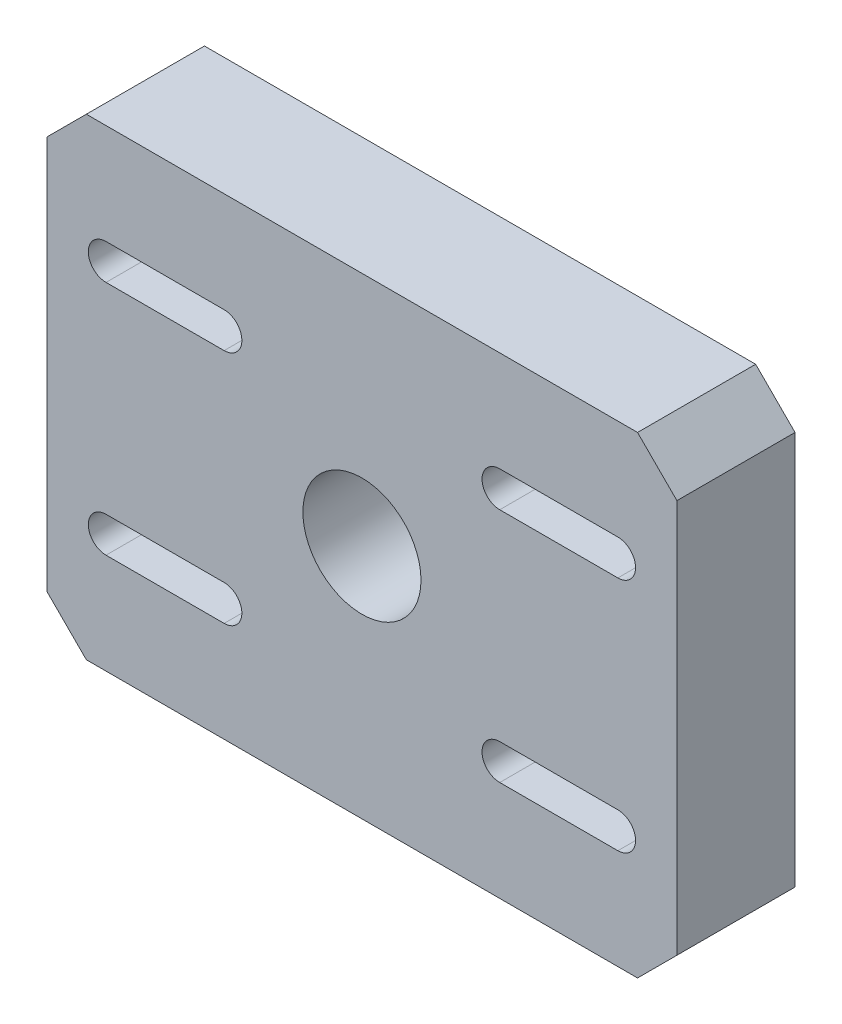
ISO-10303-21;
HEADER;
FILE_DESCRIPTION(('STEP AP214'),'2;1');
FILE_NAME('part.step','',(''),(''),'','','');
FILE_SCHEMA(('AUTOMOTIVE_DESIGN { 1 0 10303 214 1 1 1 1 }'));
ENDSEC;
DATA;
#1=APPLICATION_CONTEXT('core data for automotive mechanical design processes');
#2=APPLICATION_PROTOCOL_DEFINITION('international standard','automotive_design',2000,#1);
#3=PRODUCT_CONTEXT('',#1,'mechanical');
#4=PRODUCT('Part','Part','',(#3));
#5=PRODUCT_RELATED_PRODUCT_CATEGORY('part','',(#4));
#6=PRODUCT_DEFINITION_FORMATION('','',#4);
#7=PRODUCT_DEFINITION_CONTEXT('part definition',#1,'design');
#8=PRODUCT_DEFINITION('design','',#6,#7);
#9=PRODUCT_DEFINITION_SHAPE('','',#8);
#10=(LENGTH_UNIT() NAMED_UNIT(*) SI_UNIT(.MILLI.,.METRE.));
#11=(NAMED_UNIT(*) PLANE_ANGLE_UNIT() SI_UNIT($,.RADIAN.));
#12=(NAMED_UNIT(*) SI_UNIT($,.STERADIAN.) SOLID_ANGLE_UNIT());
#13=UNCERTAINTY_MEASURE_WITH_UNIT(LENGTH_MEASURE(1.E-05),#10,'distance_accuracy_value','');
#14=(GEOMETRIC_REPRESENTATION_CONTEXT(3) GLOBAL_UNCERTAINTY_ASSIGNED_CONTEXT((#13)) GLOBAL_UNIT_ASSIGNED_CONTEXT((#10,
#11,#12)) REPRESENTATION_CONTEXT('',''));
#15=CARTESIAN_POINT('',(0.,0.,0.));
#16=DIRECTION('',(0.,0.,1.));
#17=DIRECTION('',(1.,0.,0.));
#18=AXIS2_PLACEMENT_3D('',#15,#16,#17);
#19=CARTESIAN_POINT('',(-80.,-60.,30.));
#20=DIRECTION('',(1.,0.,0.));
#21=DIRECTION('',(0.,0.,-1.));
#22=AXIS2_PLACEMENT_3D('',#19,#20,#21);
#23=PLANE('',#22);
#24=DIRECTION('',(0.,-1.,0.));
#25=VECTOR('',#24,1.);
#26=CARTESIAN_POINT('',(-80.,-60.,0.));
#27=LINE('',#26,#25);
#28=CARTESIAN_POINT('',(-80.,50.,0.));
#29=VERTEX_POINT('',#28);
#30=CARTESIAN_POINT('',(-80.,-50.,0.));
#31=VERTEX_POINT('',#30);
#32=EDGE_CURVE('E333',#29,#31,#27,.T.);
#33=ORIENTED_EDGE('',*,*,#32,.T.);
#34=DIRECTION('',(0.,0.,1.));
#35=VECTOR('',#34,1.);
#36=CARTESIAN_POINT('',(-80.,-50.,30.));
#37=LINE('',#36,#35);
#38=CARTESIAN_POINT('',(-80.,-50.,30.));
#39=VERTEX_POINT('',#38);
#40=EDGE_CURVE('E11',#31,#39,#37,.T.);
#41=ORIENTED_EDGE('',*,*,#40,.T.);
#42=DIRECTION('',(0.,-1.,0.));
#43=VECTOR('',#42,1.);
#44=CARTESIAN_POINT('',(-80.,-60.,30.));
#45=LINE('',#44,#43);
#46=CARTESIAN_POINT('',(-80.,50.,30.));
#47=VERTEX_POINT('',#46);
#48=EDGE_CURVE('E340',#47,#39,#45,.T.);
#49=ORIENTED_EDGE('',*,*,#48,.F.);
#50=DIRECTION('',(0.,0.,-1.));
#51=VECTOR('',#50,1.);
#52=CARTESIAN_POINT('',(-80.,50.,30.));
#53=LINE('',#52,#51);
#54=EDGE_CURVE('E42',#47,#29,#53,.T.);
#55=ORIENTED_EDGE('',*,*,#54,.T.);
#56=EDGE_LOOP('',(#33,#41,#49,#55));
#57=FACE_BOUND('',#56,.T.);
#58=ADVANCED_FACE('F34',(#57),#23,.F.);
#59=CARTESIAN_POINT('',(80.,-60.,30.));
#60=DIRECTION('',(0.,1.,0.));
#61=DIRECTION('',(-1.,0.,0.));
#62=AXIS2_PLACEMENT_3D('',#59,#60,#61);
#63=PLANE('',#62);
#64=DIRECTION('',(1.,0.,0.));
#65=VECTOR('',#64,1.);
#66=CARTESIAN_POINT('',(80.,-60.,0.));
#67=LINE('',#66,#65);
#68=CARTESIAN_POINT('',(-70.,-60.,0.));
#69=VERTEX_POINT('',#68);
#70=CARTESIAN_POINT('',(70.,-60.,0.));
#71=VERTEX_POINT('',#70);
#72=EDGE_CURVE('E354',#69,#71,#67,.T.);
#73=ORIENTED_EDGE('',*,*,#72,.T.);
#74=DIRECTION('',(0.,0.,1.));
#75=VECTOR('',#74,1.);
#76=CARTESIAN_POINT('',(70.,-60.,30.));
#77=LINE('',#76,#75);
#78=CARTESIAN_POINT('',(70.,-60.,30.));
#79=VERTEX_POINT('',#78);
#80=EDGE_CURVE('E376',#71,#79,#77,.T.);
#81=ORIENTED_EDGE('',*,*,#80,.T.);
#82=DIRECTION('',(1.,0.,0.));
#83=VECTOR('',#82,1.);
#84=CARTESIAN_POINT('',(80.,-60.,30.));
#85=LINE('',#84,#83);
#86=CARTESIAN_POINT('',(-70.,-60.,30.));
#87=VERTEX_POINT('',#86);
#88=EDGE_CURVE('E343',#87,#79,#85,.T.);
#89=ORIENTED_EDGE('',*,*,#88,.F.);
#90=DIRECTION('',(0.,0.,-1.));
#91=VECTOR('',#90,1.);
#92=CARTESIAN_POINT('',(-70.,-60.,30.));
#93=LINE('',#92,#91);
#94=EDGE_CURVE('E373',#87,#69,#93,.T.);
#95=ORIENTED_EDGE('',*,*,#94,.T.);
#96=EDGE_LOOP('',(#73,#81,#89,#95));
#97=FACE_BOUND('',#96,.T.);
#98=ADVANCED_FACE('F406',(#97),#63,.F.);
#99=CARTESIAN_POINT('',(80.,-60.,30.));
#100=DIRECTION('',(-1.,0.,0.));
#101=DIRECTION('',(0.,0.,1.));
#102=AXIS2_PLACEMENT_3D('',#99,#100,#101);
#103=PLANE('',#102);
#104=DIRECTION('',(0.,1.,0.));
#105=VECTOR('',#104,1.);
#106=CARTESIAN_POINT('',(80.,-60.,30.));
#107=LINE('',#106,#105);
#108=CARTESIAN_POINT('',(80.,-50.,30.));
#109=VERTEX_POINT('',#108);
#110=CARTESIAN_POINT('',(80.,49.9999999999999,30.));
#111=VERTEX_POINT('',#110);
#112=EDGE_CURVE('E347',#109,#111,#107,.T.);
#113=ORIENTED_EDGE('',*,*,#112,.F.);
#114=DIRECTION('',(0.,0.,-1.));
#115=VECTOR('',#114,1.);
#116=CARTESIAN_POINT('',(80.,-50.,30.));
#117=LINE('',#116,#115);
#118=CARTESIAN_POINT('',(80.,-50.,0.));
#119=VERTEX_POINT('',#118);
#120=EDGE_CURVE('E362',#109,#119,#117,.T.);
#121=ORIENTED_EDGE('',*,*,#120,.T.);
#122=DIRECTION('',(0.,1.,0.));
#123=VECTOR('',#122,1.);
#124=CARTESIAN_POINT('',(80.,-60.,0.));
#125=LINE('',#124,#123);
#126=CARTESIAN_POINT('',(80.,50.,0.));
#127=VERTEX_POINT('',#126);
#128=EDGE_CURVE('E357',#119,#127,#125,.T.);
#129=ORIENTED_EDGE('',*,*,#128,.T.);
#130=DIRECTION('',(0.,0.,1.));
#131=VECTOR('',#130,1.);
#132=CARTESIAN_POINT('',(80.,50.,30.));
#133=LINE('',#132,#131);
#134=EDGE_CURVE('E351',#127,#111,#133,.T.);
#135=ORIENTED_EDGE('',*,*,#134,.T.);
#136=EDGE_LOOP('',(#113,#121,#129,#135));
#137=FACE_BOUND('',#136,.T.);
#138=ADVANCED_FACE('F415',(#137),#103,.F.);
#139=CARTESIAN_POINT('',(80.,60.,30.));
#140=DIRECTION('',(0.,-1.,0.));
#141=DIRECTION('',(1.,0.,0.));
#142=AXIS2_PLACEMENT_3D('',#139,#140,#141);
#143=PLANE('',#142);
#144=DIRECTION('',(-1.,0.,0.));
#145=VECTOR('',#144,1.);
#146=CARTESIAN_POINT('',(80.,60.,30.));
#147=LINE('',#146,#145);
#148=CARTESIAN_POINT('',(70.,60.,30.));
#149=VERTEX_POINT('',#148);
#150=CARTESIAN_POINT('',(-70.,60.,30.));
#151=VERTEX_POINT('',#150);
#152=EDGE_CURVE('E349',#149,#151,#147,.T.);
#153=ORIENTED_EDGE('',*,*,#152,.F.);
#154=DIRECTION('',(0.,0.,-1.));
#155=VECTOR('',#154,1.);
#156=CARTESIAN_POINT('',(70.,60.,30.));
#157=LINE('',#156,#155);
#158=CARTESIAN_POINT('',(70.,60.,0.));
#159=VERTEX_POINT('',#158);
#160=EDGE_CURVE('E386',#149,#159,#157,.T.);
#161=ORIENTED_EDGE('',*,*,#160,.T.);
#162=DIRECTION('',(-1.,0.,0.));
#163=VECTOR('',#162,1.);
#164=CARTESIAN_POINT('',(80.,60.,0.));
#165=LINE('',#164,#163);
#166=CARTESIAN_POINT('',(-70.,60.,0.));
#167=VERTEX_POINT('',#166);
#168=EDGE_CURVE('E344',#159,#167,#165,.T.);
#169=ORIENTED_EDGE('',*,*,#168,.T.);
#170=DIRECTION('',(0.,0.,1.));
#171=VECTOR('',#170,1.);
#172=CARTESIAN_POINT('',(-70.,60.,30.));
#173=LINE('',#172,#171);
#174=EDGE_CURVE('E49',#167,#151,#173,.T.);
#175=ORIENTED_EDGE('',*,*,#174,.T.);
#176=EDGE_LOOP('',(#153,#161,#169,#175));
#177=FACE_BOUND('',#176,.T.);
#178=ADVANCED_FACE('F420',(#177),#143,.F.);
#179=CARTESIAN_POINT('',(0.,0.,30.));
#180=DIRECTION('',(0.,0.,1.));
#181=DIRECTION('',(1.,0.,0.));
#182=AXIS2_PLACEMENT_3D('',#179,#180,#181);
#183=PLANE('',#182);
#184=CARTESIAN_POINT('',(0.,0.,30.));
#185=DIRECTION('',(0.,0.,1.));
#186=DIRECTION('',(1.,0.,0.));
#187=AXIS2_PLACEMENT_3D('',#184,#185,#186);
#188=CIRCLE('',#187,15.);
#189=CARTESIAN_POINT('',(15.,0.,30.));
#190=VERTEX_POINT('',#189);
#191=EDGE_CURVE('E227',#190,#190,#188,.T.);
#192=ORIENTED_EDGE('',*,*,#191,.F.);
#193=EDGE_LOOP('',(#192));
#194=FACE_BOUND('',#193,.T.);
#195=CARTESIAN_POINT('',(65.,-30.,30.));
#196=DIRECTION('',(0.,0.,1.));
#197=DIRECTION('',(1.,0.,0.));
#198=AXIS2_PLACEMENT_3D('',#195,#196,#197);
#199=CIRCLE('',#198,4.5);
#200=CARTESIAN_POINT('',(65.,-34.5,30.));
#201=VERTEX_POINT('',#200);
#202=CARTESIAN_POINT('',(65.,-25.5,30.));
#203=VERTEX_POINT('',#202);
#204=EDGE_CURVE('E203',#201,#203,#199,.T.);
#205=ORIENTED_EDGE('',*,*,#204,.F.);
#206=DIRECTION('',(1.,0.,0.));
#207=VECTOR('',#206,1.);
#208=CARTESIAN_POINT('',(65.,-34.5,30.));
#209=LINE('',#208,#207);
#210=CARTESIAN_POINT('',(35.,-34.5,30.));
#211=VERTEX_POINT('',#210);
#212=EDGE_CURVE('E221',#211,#201,#209,.T.);
#213=ORIENTED_EDGE('',*,*,#212,.F.);
#214=CARTESIAN_POINT('',(35.,-30.,30.));
#215=DIRECTION('',(0.,0.,1.));
#216=DIRECTION('',(1.,0.,0.));
#217=AXIS2_PLACEMENT_3D('',#214,#215,#216);
#218=CIRCLE('',#217,4.5);
#219=CARTESIAN_POINT('',(35.,-25.5,30.));
#220=VERTEX_POINT('',#219);
#221=EDGE_CURVE('E224',#220,#211,#218,.T.);
#222=ORIENTED_EDGE('',*,*,#221,.F.);
#223=DIRECTION('',(-1.,0.,0.));
#224=VECTOR('',#223,1.);
#225=CARTESIAN_POINT('',(65.,-25.5,30.));
#226=LINE('',#225,#224);
#227=EDGE_CURVE('E233',#203,#220,#226,.T.);
#228=ORIENTED_EDGE('',*,*,#227,.F.);
#229=EDGE_LOOP('',(#205,#213,#222,#228));
#230=FACE_BOUND('',#229,.T.);
#231=CARTESIAN_POINT('',(-65.,-30.,30.));
#232=DIRECTION('',(0.,0.,1.));
#233=DIRECTION('',(1.,0.,0.));
#234=AXIS2_PLACEMENT_3D('',#231,#232,#233);
#235=CIRCLE('',#234,4.5);
#236=CARTESIAN_POINT('',(-65.,-25.5,30.));
#237=VERTEX_POINT('',#236);
#238=CARTESIAN_POINT('',(-65.,-34.5,30.));
#239=VERTEX_POINT('',#238);
#240=EDGE_CURVE('E240',#237,#239,#235,.T.);
#241=ORIENTED_EDGE('',*,*,#240,.F.);
#242=DIRECTION('',(-1.,0.,0.));
#243=VECTOR('',#242,1.);
#244=CARTESIAN_POINT('',(-65.,-25.5,30.));
#245=LINE('',#244,#243);
#246=CARTESIAN_POINT('',(-35.,-25.5,30.));
#247=VERTEX_POINT('',#246);
#248=EDGE_CURVE('E248',#247,#237,#245,.T.);
#249=ORIENTED_EDGE('',*,*,#248,.F.);
#250=CARTESIAN_POINT('',(-35.,-30.,30.));
#251=DIRECTION('',(0.,0.,1.));
#252=DIRECTION('',(1.,0.,0.));
#253=AXIS2_PLACEMENT_3D('',#250,#251,#252);
#254=CIRCLE('',#253,4.5);
#255=CARTESIAN_POINT('',(-35.,-34.5,30.));
#256=VERTEX_POINT('',#255);
#257=EDGE_CURVE('E262',#256,#247,#254,.T.);
#258=ORIENTED_EDGE('',*,*,#257,.F.);
#259=DIRECTION('',(1.,0.,0.));
#260=VECTOR('',#259,1.);
#261=CARTESIAN_POINT('',(-65.,-34.5,30.));
#262=LINE('',#261,#260);
#263=EDGE_CURVE('E259',#239,#256,#262,.T.);
#264=ORIENTED_EDGE('',*,*,#263,.F.);
#265=EDGE_LOOP('',(#241,#249,#258,#264));
#266=FACE_BOUND('',#265,.T.);
#267=CARTESIAN_POINT('',(65.,30.,30.));
#268=DIRECTION('',(0.,0.,1.));
#269=DIRECTION('',(1.,0.,0.));
#270=AXIS2_PLACEMENT_3D('',#267,#268,#269);
#271=CIRCLE('',#270,4.49999999999999);
#272=CARTESIAN_POINT('',(65.,25.5,30.));
#273=VERTEX_POINT('',#272);
#274=CARTESIAN_POINT('',(65.,34.5,30.));
#275=VERTEX_POINT('',#274);
#276=EDGE_CURVE('E269',#273,#275,#271,.T.);
#277=ORIENTED_EDGE('',*,*,#276,.F.);
#278=DIRECTION('',(1.,0.,0.));
#279=VECTOR('',#278,1.);
#280=CARTESIAN_POINT('',(65.,25.5,30.));
#281=LINE('',#280,#279);
#282=CARTESIAN_POINT('',(35.,25.5,30.));
#283=VERTEX_POINT('',#282);
#284=EDGE_CURVE('E280',#283,#273,#281,.T.);
#285=ORIENTED_EDGE('',*,*,#284,.F.);
#286=CARTESIAN_POINT('',(35.,30.,30.));
#287=DIRECTION('',(0.,0.,1.));
#288=DIRECTION('',(1.,0.,0.));
#289=AXIS2_PLACEMENT_3D('',#286,#287,#288);
#290=CIRCLE('',#289,4.5);
#291=CARTESIAN_POINT('',(35.,34.5,30.));
#292=VERTEX_POINT('',#291);
#293=EDGE_CURVE('E294',#292,#283,#290,.T.);
#294=ORIENTED_EDGE('',*,*,#293,.F.);
#295=DIRECTION('',(-1.,0.,0.));
#296=VECTOR('',#295,1.);
#297=CARTESIAN_POINT('',(65.,34.5,30.));
#298=LINE('',#297,#296);
#299=EDGE_CURVE('E291',#275,#292,#298,.T.);
#300=ORIENTED_EDGE('',*,*,#299,.F.);
#301=EDGE_LOOP('',(#277,#285,#294,#300));
#302=FACE_BOUND('',#301,.T.);
#303=CARTESIAN_POINT('',(-65.,30.,30.));
#304=DIRECTION('',(0.,0.,1.));
#305=DIRECTION('',(1.,0.,0.));
#306=AXIS2_PLACEMENT_3D('',#303,#304,#305);
#307=CIRCLE('',#306,4.49999999999999);
#308=CARTESIAN_POINT('',(-65.,34.5,30.));
#309=VERTEX_POINT('',#308);
#310=CARTESIAN_POINT('',(-65.,25.5,30.));
#311=VERTEX_POINT('',#310);
#312=EDGE_CURVE('E301',#309,#311,#307,.T.);
#313=ORIENTED_EDGE('',*,*,#312,.F.);
#314=DIRECTION('',(-1.,0.,0.));
#315=VECTOR('',#314,1.);
#316=CARTESIAN_POINT('',(-65.,34.5,30.));
#317=LINE('',#316,#315);
#318=CARTESIAN_POINT('',(-35.,34.5,30.));
#319=VERTEX_POINT('',#318);
#320=EDGE_CURVE('E312',#319,#309,#317,.T.);
#321=ORIENTED_EDGE('',*,*,#320,.F.);
#322=CARTESIAN_POINT('',(-35.,30.,30.));
#323=DIRECTION('',(0.,0.,1.));
#324=DIRECTION('',(1.,0.,0.));
#325=AXIS2_PLACEMENT_3D('',#322,#323,#324);
#326=CIRCLE('',#325,4.49999999999999);
#327=CARTESIAN_POINT('',(-35.,25.5,30.));
#328=VERTEX_POINT('',#327);
#329=EDGE_CURVE('E326',#328,#319,#326,.T.);
#330=ORIENTED_EDGE('',*,*,#329,.F.);
#331=DIRECTION('',(1.,0.,0.));
#332=VECTOR('',#331,1.);
#333=CARTESIAN_POINT('',(-65.,25.5,30.));
#334=LINE('',#333,#332);
#335=EDGE_CURVE('E323',#311,#328,#334,.T.);
#336=ORIENTED_EDGE('',*,*,#335,.F.);
#337=EDGE_LOOP('',(#313,#321,#330,#336));
#338=FACE_BOUND('',#337,.T.);
#339=ORIENTED_EDGE('',*,*,#88,.T.);
#340=DIRECTION('',(-0.707106781186549,-0.707106781186547,0.));
#341=VECTOR('',#340,1.);
#342=CARTESIAN_POINT('',(64.9999999999999,-65.0000000000001,30.));
#343=LINE('',#342,#341);
#344=EDGE_CURVE('E383',#79,#109,#343,.F.);
#345=ORIENTED_EDGE('',*,*,#344,.T.);
#346=ORIENTED_EDGE('',*,*,#112,.T.);
#347=DIRECTION('',(0.707106781186546,-0.70710678118655,0.));
#348=VECTOR('',#347,1.);
#349=CARTESIAN_POINT('',(65.0000000000002,64.9999999999998,30.));
#350=LINE('',#349,#348);
#351=EDGE_CURVE('E56',#111,#149,#350,.F.);
#352=ORIENTED_EDGE('',*,*,#351,.T.);
#353=ORIENTED_EDGE('',*,*,#152,.T.);
#354=DIRECTION('',(0.707106781186549,0.707106781186547,0.));
#355=VECTOR('',#354,1.);
#356=CARTESIAN_POINT('',(-64.9999999999999,65.0000000000001,30.));
#357=LINE('',#356,#355);
#358=EDGE_CURVE('E378',#151,#47,#357,.F.);
#359=ORIENTED_EDGE('',*,*,#358,.T.);
#360=ORIENTED_EDGE('',*,*,#48,.T.);
#361=DIRECTION('',(-0.707106781186546,0.70710678118655,0.));
#362=VECTOR('',#361,1.);
#363=CARTESIAN_POINT('',(-65.0000000000002,-64.9999999999998,30.));
#364=LINE('',#363,#362);
#365=EDGE_CURVE('E380',#39,#87,#364,.F.);
#366=ORIENTED_EDGE('',*,*,#365,.T.);
#367=EDGE_LOOP('',(#339,#345,#346,#352,#353,#359,#360,#366));
#368=FACE_BOUND('',#367,.T.);
#369=ADVANCED_FACE('F409',(#194,#230,#266,#302,#338,#368),#183,.T.);
#370=CARTESIAN_POINT('',(0.,0.,0.));
#371=DIRECTION('',(0.,0.,1.));
#372=DIRECTION('',(1.,0.,0.));
#373=AXIS2_PLACEMENT_3D('',#370,#371,#372);
#374=PLANE('',#373);
#375=CARTESIAN_POINT('',(0.,0.,0.));
#376=DIRECTION('',(0.,0.,1.));
#377=DIRECTION('',(1.,0.,0.));
#378=AXIS2_PLACEMENT_3D('',#375,#376,#377);
#379=CIRCLE('',#378,15.);
#380=CARTESIAN_POINT('',(15.,0.,0.));
#381=VERTEX_POINT('',#380);
#382=EDGE_CURVE('E234',#381,#381,#379,.T.);
#383=ORIENTED_EDGE('',*,*,#382,.T.);
#384=EDGE_LOOP('',(#383));
#385=FACE_BOUND('',#384,.T.);
#386=DIRECTION('',(1.,0.,0.));
#387=VECTOR('',#386,1.);
#388=CARTESIAN_POINT('',(65.,-34.5,0.));
#389=LINE('',#388,#387);
#390=CARTESIAN_POINT('',(35.,-34.5,0.));
#391=VERTEX_POINT('',#390);
#392=CARTESIAN_POINT('',(65.,-34.5,0.));
#393=VERTEX_POINT('',#392);
#394=EDGE_CURVE('E208',#391,#393,#389,.T.);
#395=ORIENTED_EDGE('',*,*,#394,.T.);
#396=CARTESIAN_POINT('',(65.,-30.,0.));
#397=DIRECTION('',(0.,0.,1.));
#398=DIRECTION('',(1.,0.,0.));
#399=AXIS2_PLACEMENT_3D('',#396,#397,#398);
#400=CIRCLE('',#399,4.5);
#401=CARTESIAN_POINT('',(65.,-25.5,0.));
#402=VERTEX_POINT('',#401);
#403=EDGE_CURVE('E200',#393,#402,#400,.T.);
#404=ORIENTED_EDGE('',*,*,#403,.T.);
#405=DIRECTION('',(-1.,0.,0.));
#406=VECTOR('',#405,1.);
#407=CARTESIAN_POINT('',(65.,-25.5,0.));
#408=LINE('',#407,#406);
#409=CARTESIAN_POINT('',(35.,-25.5,0.));
#410=VERTEX_POINT('',#409);
#411=EDGE_CURVE('E212',#402,#410,#408,.T.);
#412=ORIENTED_EDGE('',*,*,#411,.T.);
#413=CARTESIAN_POINT('',(35.,-30.,0.));
#414=DIRECTION('',(0.,0.,1.));
#415=DIRECTION('',(1.,0.,0.));
#416=AXIS2_PLACEMENT_3D('',#413,#414,#415);
#417=CIRCLE('',#416,4.5);
#418=EDGE_CURVE('E216',#410,#391,#417,.T.);
#419=ORIENTED_EDGE('',*,*,#418,.T.);
#420=EDGE_LOOP('',(#395,#404,#412,#419));
#421=FACE_BOUND('',#420,.T.);
#422=DIRECTION('',(-1.,0.,0.));
#423=VECTOR('',#422,1.);
#424=CARTESIAN_POINT('',(-65.,-25.5,0.));
#425=LINE('',#424,#423);
#426=CARTESIAN_POINT('',(-35.,-25.5,0.));
#427=VERTEX_POINT('',#426);
#428=CARTESIAN_POINT('',(-65.,-25.5,0.));
#429=VERTEX_POINT('',#428);
#430=EDGE_CURVE('E254',#427,#429,#425,.T.);
#431=ORIENTED_EDGE('',*,*,#430,.T.);
#432=CARTESIAN_POINT('',(-65.,-30.,0.));
#433=DIRECTION('',(0.,0.,1.));
#434=DIRECTION('',(1.,0.,0.));
#435=AXIS2_PLACEMENT_3D('',#432,#433,#434);
#436=CIRCLE('',#435,4.5);
#437=CARTESIAN_POINT('',(-65.,-34.5,0.));
#438=VERTEX_POINT('',#437);
#439=EDGE_CURVE('E244',#429,#438,#436,.T.);
#440=ORIENTED_EDGE('',*,*,#439,.T.);
#441=DIRECTION('',(1.,0.,0.));
#442=VECTOR('',#441,1.);
#443=CARTESIAN_POINT('',(-65.,-34.5,0.));
#444=LINE('',#443,#442);
#445=CARTESIAN_POINT('',(-35.,-34.5,0.));
#446=VERTEX_POINT('',#445);
#447=EDGE_CURVE('E247',#438,#446,#444,.T.);
#448=ORIENTED_EDGE('',*,*,#447,.T.);
#449=CARTESIAN_POINT('',(-35.,-30.,0.));
#450=DIRECTION('',(0.,0.,1.));
#451=DIRECTION('',(1.,0.,0.));
#452=AXIS2_PLACEMENT_3D('',#449,#450,#451);
#453=CIRCLE('',#452,4.5);
#454=EDGE_CURVE('E251',#446,#427,#453,.T.);
#455=ORIENTED_EDGE('',*,*,#454,.T.);
#456=EDGE_LOOP('',(#431,#440,#448,#455));
#457=FACE_BOUND('',#456,.T.);
#458=DIRECTION('',(1.,0.,0.));
#459=VECTOR('',#458,1.);
#460=CARTESIAN_POINT('',(65.,25.5,0.));
#461=LINE('',#460,#459);
#462=CARTESIAN_POINT('',(35.,25.5,0.));
#463=VERTEX_POINT('',#462);
#464=CARTESIAN_POINT('',(65.,25.5,0.));
#465=VERTEX_POINT('',#464);
#466=EDGE_CURVE('E286',#463,#465,#461,.T.);
#467=ORIENTED_EDGE('',*,*,#466,.T.);
#468=CARTESIAN_POINT('',(65.,30.,0.));
#469=DIRECTION('',(0.,0.,1.));
#470=DIRECTION('',(1.,0.,0.));
#471=AXIS2_PLACEMENT_3D('',#468,#469,#470);
#472=CIRCLE('',#471,4.49999999999999);
#473=CARTESIAN_POINT('',(65.,34.5,0.));
#474=VERTEX_POINT('',#473);
#475=EDGE_CURVE('E276',#465,#474,#472,.T.);
#476=ORIENTED_EDGE('',*,*,#475,.T.);
#477=DIRECTION('',(-1.,0.,0.));
#478=VECTOR('',#477,1.);
#479=CARTESIAN_POINT('',(65.,34.5,0.));
#480=LINE('',#479,#478);
#481=CARTESIAN_POINT('',(35.,34.5,0.));
#482=VERTEX_POINT('',#481);
#483=EDGE_CURVE('E279',#474,#482,#480,.T.);
#484=ORIENTED_EDGE('',*,*,#483,.T.);
#485=CARTESIAN_POINT('',(35.,30.,0.));
#486=DIRECTION('',(0.,0.,1.));
#487=DIRECTION('',(1.,0.,0.));
#488=AXIS2_PLACEMENT_3D('',#485,#486,#487);
#489=CIRCLE('',#488,4.5);
#490=EDGE_CURVE('E283',#482,#463,#489,.T.);
#491=ORIENTED_EDGE('',*,*,#490,.T.);
#492=EDGE_LOOP('',(#467,#476,#484,#491));
#493=FACE_BOUND('',#492,.T.);
#494=DIRECTION('',(-1.,0.,0.));
#495=VECTOR('',#494,1.);
#496=CARTESIAN_POINT('',(-65.,34.5,0.));
#497=LINE('',#496,#495);
#498=CARTESIAN_POINT('',(-35.,34.5,0.));
#499=VERTEX_POINT('',#498);
#500=CARTESIAN_POINT('',(-65.,34.5,0.));
#501=VERTEX_POINT('',#500);
#502=EDGE_CURVE('E318',#499,#501,#497,.T.);
#503=ORIENTED_EDGE('',*,*,#502,.T.);
#504=CARTESIAN_POINT('',(-65.,30.,0.));
#505=DIRECTION('',(0.,0.,1.));
#506=DIRECTION('',(1.,0.,0.));
#507=AXIS2_PLACEMENT_3D('',#504,#505,#506);
#508=CIRCLE('',#507,4.49999999999999);
#509=CARTESIAN_POINT('',(-65.,25.5,0.));
#510=VERTEX_POINT('',#509);
#511=EDGE_CURVE('E308',#501,#510,#508,.T.);
#512=ORIENTED_EDGE('',*,*,#511,.T.);
#513=DIRECTION('',(1.,0.,0.));
#514=VECTOR('',#513,1.);
#515=CARTESIAN_POINT('',(-65.,25.5,0.));
#516=LINE('',#515,#514);
#517=CARTESIAN_POINT('',(-35.,25.5,0.));
#518=VERTEX_POINT('',#517);
#519=EDGE_CURVE('E311',#510,#518,#516,.T.);
#520=ORIENTED_EDGE('',*,*,#519,.T.);
#521=CARTESIAN_POINT('',(-35.,30.,0.));
#522=DIRECTION('',(0.,0.,1.));
#523=DIRECTION('',(1.,0.,0.));
#524=AXIS2_PLACEMENT_3D('',#521,#522,#523);
#525=CIRCLE('',#524,4.49999999999999);
#526=EDGE_CURVE('E315',#518,#499,#525,.T.);
#527=ORIENTED_EDGE('',*,*,#526,.T.);
#528=EDGE_LOOP('',(#503,#512,#520,#527));
#529=FACE_BOUND('',#528,.T.);
#530=ORIENTED_EDGE('',*,*,#128,.F.);
#531=DIRECTION('',(0.707106781186549,0.707106781186547,0.));
#532=VECTOR('',#531,1.);
#533=CARTESIAN_POINT('',(80.,-50.,0.));
#534=LINE('',#533,#532);
#535=EDGE_CURVE('E371',#119,#71,#534,.F.);
#536=ORIENTED_EDGE('',*,*,#535,.T.);
#537=ORIENTED_EDGE('',*,*,#72,.F.);
#538=DIRECTION('',(0.707106781186546,-0.70710678118655,0.));
#539=VECTOR('',#538,1.);
#540=CARTESIAN_POINT('',(-70.,-60.,0.));
#541=LINE('',#540,#539);
#542=EDGE_CURVE('E367',#69,#31,#541,.F.);
#543=ORIENTED_EDGE('',*,*,#542,.T.);
#544=ORIENTED_EDGE('',*,*,#32,.F.);
#545=DIRECTION('',(-0.707106781186549,-0.707106781186547,0.));
#546=VECTOR('',#545,1.);
#547=CARTESIAN_POINT('',(-80.,50.,0.));
#548=LINE('',#547,#546);
#549=EDGE_CURVE('E365',#29,#167,#548,.F.);
#550=ORIENTED_EDGE('',*,*,#549,.T.);
#551=ORIENTED_EDGE('',*,*,#168,.F.);
#552=DIRECTION('',(-0.707106781186546,0.70710678118655,0.));
#553=VECTOR('',#552,1.);
#554=CARTESIAN_POINT('',(70.,60.,0.));
#555=LINE('',#554,#553);
#556=EDGE_CURVE('E369',#159,#127,#555,.F.);
#557=ORIENTED_EDGE('',*,*,#556,.T.);
#558=EDGE_LOOP('',(#530,#536,#537,#543,#544,#550,#551,#557));
#559=FACE_BOUND('',#558,.T.);
#560=ADVANCED_FACE('F218',(#385,#421,#457,#493,#529,#559),#374,.F.);
#561=CARTESIAN_POINT('',(-65.,30.,0.));
#562=DIRECTION('',(0.,0.,1.));
#563=DIRECTION('',(1.,0.,0.));
#564=AXIS2_PLACEMENT_3D('',#561,#562,#563);
#565=CYLINDRICAL_SURFACE('',#564,4.49999999999999);
#566=ORIENTED_EDGE('',*,*,#312,.T.);
#567=DIRECTION('',(0.,0.,1.));
#568=VECTOR('',#567,1.);
#569=CARTESIAN_POINT('',(-65.,25.5,0.));
#570=LINE('',#569,#568);
#571=EDGE_CURVE('E321',#510,#311,#570,.T.);
#572=ORIENTED_EDGE('',*,*,#571,.F.);
#573=ORIENTED_EDGE('',*,*,#511,.F.);
#574=DIRECTION('',(0.,0.,1.));
#575=VECTOR('',#574,1.);
#576=CARTESIAN_POINT('',(-65.,34.5,0.));
#577=LINE('',#576,#575);
#578=EDGE_CURVE('E331',#501,#309,#577,.T.);
#579=ORIENTED_EDGE('',*,*,#578,.T.);
#580=EDGE_LOOP('',(#566,#572,#573,#579));
#581=FACE_BOUND('',#580,.T.);
#582=ADVANCED_FACE('F474',(#581),#565,.F.);
#583=CARTESIAN_POINT('',(-65.,34.5,0.));
#584=DIRECTION('',(0.,1.,0.));
#585=DIRECTION('',(-1.,0.,0.));
#586=AXIS2_PLACEMENT_3D('',#583,#584,#585);
#587=PLANE('',#586);
#588=ORIENTED_EDGE('',*,*,#320,.T.);
#589=ORIENTED_EDGE('',*,*,#578,.F.);
#590=ORIENTED_EDGE('',*,*,#502,.F.);
#591=DIRECTION('',(0.,0.,1.));
#592=VECTOR('',#591,1.);
#593=CARTESIAN_POINT('',(-35.,34.5,0.));
#594=LINE('',#593,#592);
#595=EDGE_CURVE('E334',#499,#319,#594,.T.);
#596=ORIENTED_EDGE('',*,*,#595,.T.);
#597=EDGE_LOOP('',(#588,#589,#590,#596));
#598=FACE_BOUND('',#597,.T.);
#599=ADVANCED_FACE('F489',(#598),#587,.F.);
#600=CARTESIAN_POINT('',(-35.,30.,0.));
#601=DIRECTION('',(0.,0.,1.));
#602=DIRECTION('',(1.,0.,0.));
#603=AXIS2_PLACEMENT_3D('',#600,#601,#602);
#604=CYLINDRICAL_SURFACE('',#603,4.49999999999999);
#605=ORIENTED_EDGE('',*,*,#329,.T.);
#606=ORIENTED_EDGE('',*,*,#595,.F.);
#607=ORIENTED_EDGE('',*,*,#526,.F.);
#608=DIRECTION('',(0.,0.,1.));
#609=VECTOR('',#608,1.);
#610=CARTESIAN_POINT('',(-35.,25.5,0.));
#611=LINE('',#610,#609);
#612=EDGE_CURVE('E336',#518,#328,#611,.T.);
#613=ORIENTED_EDGE('',*,*,#612,.T.);
#614=EDGE_LOOP('',(#605,#606,#607,#613));
#615=FACE_BOUND('',#614,.T.);
#616=ADVANCED_FACE('F496',(#615),#604,.F.);
#617=CARTESIAN_POINT('',(-65.,25.5,0.));
#618=DIRECTION('',(0.,-1.,0.));
#619=DIRECTION('',(1.,0.,0.));
#620=AXIS2_PLACEMENT_3D('',#617,#618,#619);
#621=PLANE('',#620);
#622=ORIENTED_EDGE('',*,*,#335,.T.);
#623=ORIENTED_EDGE('',*,*,#612,.F.);
#624=ORIENTED_EDGE('',*,*,#519,.F.);
#625=ORIENTED_EDGE('',*,*,#571,.T.);
#626=EDGE_LOOP('',(#622,#623,#624,#625));
#627=FACE_BOUND('',#626,.T.);
#628=ADVANCED_FACE('F504',(#627),#621,.F.);
#629=CARTESIAN_POINT('',(65.,30.,0.));
#630=DIRECTION('',(0.,0.,1.));
#631=DIRECTION('',(1.,0.,0.));
#632=AXIS2_PLACEMENT_3D('',#629,#630,#631);
#633=CYLINDRICAL_SURFACE('',#632,4.49999999999999);
#634=ORIENTED_EDGE('',*,*,#276,.T.);
#635=DIRECTION('',(0.,0.,1.));
#636=VECTOR('',#635,1.);
#637=CARTESIAN_POINT('',(65.,34.5,0.));
#638=LINE('',#637,#636);
#639=EDGE_CURVE('E289',#474,#275,#638,.T.);
#640=ORIENTED_EDGE('',*,*,#639,.F.);
#641=ORIENTED_EDGE('',*,*,#475,.F.);
#642=DIRECTION('',(0.,0.,1.));
#643=VECTOR('',#642,1.);
#644=CARTESIAN_POINT('',(65.,25.5,0.));
#645=LINE('',#644,#643);
#646=EDGE_CURVE('E299',#465,#273,#645,.T.);
#647=ORIENTED_EDGE('',*,*,#646,.T.);
#648=EDGE_LOOP('',(#634,#640,#641,#647));
#649=FACE_BOUND('',#648,.T.);
#650=ADVANCED_FACE('F512',(#649),#633,.F.);
#651=CARTESIAN_POINT('',(65.,25.5,0.));
#652=DIRECTION('',(0.,-1.,0.));
#653=DIRECTION('',(1.,0.,0.));
#654=AXIS2_PLACEMENT_3D('',#651,#652,#653);
#655=PLANE('',#654);
#656=ORIENTED_EDGE('',*,*,#284,.T.);
#657=ORIENTED_EDGE('',*,*,#646,.F.);
#658=ORIENTED_EDGE('',*,*,#466,.F.);
#659=DIRECTION('',(0.,0.,1.));
#660=VECTOR('',#659,1.);
#661=CARTESIAN_POINT('',(35.,25.5,0.));
#662=LINE('',#661,#660);
#663=EDGE_CURVE('E302',#463,#283,#662,.T.);
#664=ORIENTED_EDGE('',*,*,#663,.T.);
#665=EDGE_LOOP('',(#656,#657,#658,#664));
#666=FACE_BOUND('',#665,.T.);
#667=ADVANCED_FACE('F520',(#666),#655,.F.);
#668=CARTESIAN_POINT('',(35.,30.,0.));
#669=DIRECTION('',(0.,0.,1.));
#670=DIRECTION('',(1.,0.,0.));
#671=AXIS2_PLACEMENT_3D('',#668,#669,#670);
#672=CYLINDRICAL_SURFACE('',#671,4.5);
#673=ORIENTED_EDGE('',*,*,#293,.T.);
#674=ORIENTED_EDGE('',*,*,#663,.F.);
#675=ORIENTED_EDGE('',*,*,#490,.F.);
#676=DIRECTION('',(0.,0.,1.));
#677=VECTOR('',#676,1.);
#678=CARTESIAN_POINT('',(35.,34.5,0.));
#679=LINE('',#678,#677);
#680=EDGE_CURVE('E304',#482,#292,#679,.T.);
#681=ORIENTED_EDGE('',*,*,#680,.T.);
#682=EDGE_LOOP('',(#673,#674,#675,#681));
#683=FACE_BOUND('',#682,.T.);
#684=ADVANCED_FACE('F528',(#683),#672,.F.);
#685=CARTESIAN_POINT('',(65.,34.5,0.));
#686=DIRECTION('',(0.,1.,0.));
#687=DIRECTION('',(-1.,0.,0.));
#688=AXIS2_PLACEMENT_3D('',#685,#686,#687);
#689=PLANE('',#688);
#690=ORIENTED_EDGE('',*,*,#299,.T.);
#691=ORIENTED_EDGE('',*,*,#680,.F.);
#692=ORIENTED_EDGE('',*,*,#483,.F.);
#693=ORIENTED_EDGE('',*,*,#639,.T.);
#694=EDGE_LOOP('',(#690,#691,#692,#693));
#695=FACE_BOUND('',#694,.T.);
#696=ADVANCED_FACE('F536',(#695),#689,.F.);
#697=CARTESIAN_POINT('',(-65.,-30.,0.));
#698=DIRECTION('',(0.,0.,1.));
#699=DIRECTION('',(1.,0.,0.));
#700=AXIS2_PLACEMENT_3D('',#697,#698,#699);
#701=CYLINDRICAL_SURFACE('',#700,4.5);
#702=ORIENTED_EDGE('',*,*,#240,.T.);
#703=DIRECTION('',(0.,0.,1.));
#704=VECTOR('',#703,1.);
#705=CARTESIAN_POINT('',(-65.,-34.5,0.));
#706=LINE('',#705,#704);
#707=EDGE_CURVE('E257',#438,#239,#706,.T.);
#708=ORIENTED_EDGE('',*,*,#707,.F.);
#709=ORIENTED_EDGE('',*,*,#439,.F.);
#710=DIRECTION('',(0.,0.,1.));
#711=VECTOR('',#710,1.);
#712=CARTESIAN_POINT('',(-65.,-25.5,0.));
#713=LINE('',#712,#711);
#714=EDGE_CURVE('E267',#429,#237,#713,.T.);
#715=ORIENTED_EDGE('',*,*,#714,.T.);
#716=EDGE_LOOP('',(#702,#708,#709,#715));
#717=FACE_BOUND('',#716,.T.);
#718=ADVANCED_FACE('F544',(#717),#701,.F.);
#719=CARTESIAN_POINT('',(-65.,-25.5,0.));
#720=DIRECTION('',(0.,1.,0.));
#721=DIRECTION('',(-1.,0.,0.));
#722=AXIS2_PLACEMENT_3D('',#719,#720,#721);
#723=PLANE('',#722);
#724=ORIENTED_EDGE('',*,*,#248,.T.);
#725=ORIENTED_EDGE('',*,*,#714,.F.);
#726=ORIENTED_EDGE('',*,*,#430,.F.);
#727=DIRECTION('',(0.,0.,1.));
#728=VECTOR('',#727,1.);
#729=CARTESIAN_POINT('',(-35.,-25.5,0.));
#730=LINE('',#729,#728);
#731=EDGE_CURVE('E270',#427,#247,#730,.T.);
#732=ORIENTED_EDGE('',*,*,#731,.T.);
#733=EDGE_LOOP('',(#724,#725,#726,#732));
#734=FACE_BOUND('',#733,.T.);
#735=ADVANCED_FACE('F552',(#734),#723,.F.);
#736=CARTESIAN_POINT('',(-35.,-30.,0.));
#737=DIRECTION('',(0.,0.,1.));
#738=DIRECTION('',(1.,0.,0.));
#739=AXIS2_PLACEMENT_3D('',#736,#737,#738);
#740=CYLINDRICAL_SURFACE('',#739,4.5);
#741=ORIENTED_EDGE('',*,*,#257,.T.);
#742=ORIENTED_EDGE('',*,*,#731,.F.);
#743=ORIENTED_EDGE('',*,*,#454,.F.);
#744=DIRECTION('',(0.,0.,1.));
#745=VECTOR('',#744,1.);
#746=CARTESIAN_POINT('',(-35.,-34.5,0.));
#747=LINE('',#746,#745);
#748=EDGE_CURVE('E272',#446,#256,#747,.T.);
#749=ORIENTED_EDGE('',*,*,#748,.T.);
#750=EDGE_LOOP('',(#741,#742,#743,#749));
#751=FACE_BOUND('',#750,.T.);
#752=ADVANCED_FACE('F560',(#751),#740,.F.);
#753=CARTESIAN_POINT('',(-65.,-34.5,0.));
#754=DIRECTION('',(0.,-1.,0.));
#755=DIRECTION('',(1.,0.,0.));
#756=AXIS2_PLACEMENT_3D('',#753,#754,#755);
#757=PLANE('',#756);
#758=ORIENTED_EDGE('',*,*,#263,.T.);
#759=ORIENTED_EDGE('',*,*,#748,.F.);
#760=ORIENTED_EDGE('',*,*,#447,.F.);
#761=ORIENTED_EDGE('',*,*,#707,.T.);
#762=EDGE_LOOP('',(#758,#759,#760,#761));
#763=FACE_BOUND('',#762,.T.);
#764=ADVANCED_FACE('F568',(#763),#757,.F.);
#765=CARTESIAN_POINT('',(65.,-30.,0.));
#766=DIRECTION('',(0.,0.,1.));
#767=DIRECTION('',(1.,0.,0.));
#768=AXIS2_PLACEMENT_3D('',#765,#766,#767);
#769=CYLINDRICAL_SURFACE('',#768,4.5);
#770=ORIENTED_EDGE('',*,*,#204,.T.);
#771=DIRECTION('',(0.,0.,1.));
#772=VECTOR('',#771,1.);
#773=CARTESIAN_POINT('',(65.,-25.5,0.));
#774=LINE('',#773,#772);
#775=EDGE_CURVE('E196',#402,#203,#774,.T.);
#776=ORIENTED_EDGE('',*,*,#775,.F.);
#777=ORIENTED_EDGE('',*,*,#403,.F.);
#778=DIRECTION('',(0.,0.,1.));
#779=VECTOR('',#778,1.);
#780=CARTESIAN_POINT('',(65.,-34.5,0.));
#781=LINE('',#780,#779);
#782=EDGE_CURVE('E238',#393,#201,#781,.T.);
#783=ORIENTED_EDGE('',*,*,#782,.T.);
#784=EDGE_LOOP('',(#770,#776,#777,#783));
#785=FACE_BOUND('',#784,.T.);
#786=ADVANCED_FACE('F198',(#785),#769,.F.);
#787=CARTESIAN_POINT('',(65.,-34.5,0.));
#788=DIRECTION('',(0.,-1.,0.));
#789=DIRECTION('',(1.,0.,0.));
#790=AXIS2_PLACEMENT_3D('',#787,#788,#789);
#791=PLANE('',#790);
#792=ORIENTED_EDGE('',*,*,#212,.T.);
#793=ORIENTED_EDGE('',*,*,#782,.F.);
#794=ORIENTED_EDGE('',*,*,#394,.F.);
#795=DIRECTION('',(0.,0.,1.));
#796=VECTOR('',#795,1.);
#797=CARTESIAN_POINT('',(35.,-34.5,0.));
#798=LINE('',#797,#796);
#799=EDGE_CURVE('E241',#391,#211,#798,.T.);
#800=ORIENTED_EDGE('',*,*,#799,.T.);
#801=EDGE_LOOP('',(#792,#793,#794,#800));
#802=FACE_BOUND('',#801,.T.);
#803=ADVANCED_FACE('F583',(#802),#791,.F.);
#804=CARTESIAN_POINT('',(35.,-30.,0.));
#805=DIRECTION('',(0.,0.,1.));
#806=DIRECTION('',(1.,0.,0.));
#807=AXIS2_PLACEMENT_3D('',#804,#805,#806);
#808=CYLINDRICAL_SURFACE('',#807,4.5);
#809=ORIENTED_EDGE('',*,*,#221,.T.);
#810=ORIENTED_EDGE('',*,*,#799,.F.);
#811=ORIENTED_EDGE('',*,*,#418,.F.);
#812=DIRECTION('',(0.,0.,1.));
#813=VECTOR('',#812,1.);
#814=CARTESIAN_POINT('',(35.,-25.5,0.));
#815=LINE('',#814,#813);
#816=EDGE_CURVE('E207',#410,#220,#815,.T.);
#817=ORIENTED_EDGE('',*,*,#816,.T.);
#818=EDGE_LOOP('',(#809,#810,#811,#817));
#819=FACE_BOUND('',#818,.T.);
#820=ADVANCED_FACE('F590',(#819),#808,.F.);
#821=CARTESIAN_POINT('',(65.,-25.5,0.));
#822=DIRECTION('',(0.,1.,0.));
#823=DIRECTION('',(-1.,0.,0.));
#824=AXIS2_PLACEMENT_3D('',#821,#822,#823);
#825=PLANE('',#824);
#826=ORIENTED_EDGE('',*,*,#227,.T.);
#827=ORIENTED_EDGE('',*,*,#816,.F.);
#828=ORIENTED_EDGE('',*,*,#411,.F.);
#829=ORIENTED_EDGE('',*,*,#775,.T.);
#830=EDGE_LOOP('',(#826,#827,#828,#829));
#831=FACE_BOUND('',#830,.T.);
#832=ADVANCED_FACE('F213',(#831),#825,.F.);
#833=CARTESIAN_POINT('',(80.,-50.,30.));
#834=DIRECTION('',(-0.707106781186547,0.707106781186549,0.));
#835=DIRECTION('',(0.,0.,-1.));
#836=AXIS2_PLACEMENT_3D('',#833,#834,#835);
#837=PLANE('',#836);
#838=ORIENTED_EDGE('',*,*,#344,.F.);
#839=ORIENTED_EDGE('',*,*,#80,.F.);
#840=ORIENTED_EDGE('',*,*,#535,.F.);
#841=ORIENTED_EDGE('',*,*,#120,.F.);
#842=EDGE_LOOP('',(#838,#839,#840,#841));
#843=FACE_BOUND('',#842,.T.);
#844=ADVANCED_FACE('F413',(#843),#837,.F.);
#845=CARTESIAN_POINT('',(70.,60.,30.));
#846=DIRECTION('',(-0.707106781186549,-0.707106781186545,0.));
#847=DIRECTION('',(0.,0.,-1.));
#848=AXIS2_PLACEMENT_3D('',#845,#846,#847);
#849=PLANE('',#848);
#850=ORIENTED_EDGE('',*,*,#351,.F.);
#851=ORIENTED_EDGE('',*,*,#134,.F.);
#852=ORIENTED_EDGE('',*,*,#556,.F.);
#853=ORIENTED_EDGE('',*,*,#160,.F.);
#854=EDGE_LOOP('',(#850,#851,#852,#853));
#855=FACE_BOUND('',#854,.T.);
#856=ADVANCED_FACE('F419',(#855),#849,.F.);
#857=CARTESIAN_POINT('',(-70.,-60.,30.));
#858=DIRECTION('',(0.707106781186549,0.707106781186545,0.));
#859=DIRECTION('',(0.,0.,-1.));
#860=AXIS2_PLACEMENT_3D('',#857,#858,#859);
#861=PLANE('',#860);
#862=ORIENTED_EDGE('',*,*,#365,.F.);
#863=ORIENTED_EDGE('',*,*,#40,.F.);
#864=ORIENTED_EDGE('',*,*,#542,.F.);
#865=ORIENTED_EDGE('',*,*,#94,.F.);
#866=EDGE_LOOP('',(#862,#863,#864,#865));
#867=FACE_BOUND('',#866,.T.);
#868=ADVANCED_FACE('F403',(#867),#861,.F.);
#869=CARTESIAN_POINT('',(-80.,50.,30.));
#870=DIRECTION('',(0.707106781186546,-0.707106781186548,0.));
#871=DIRECTION('',(0.,0.,-1.));
#872=AXIS2_PLACEMENT_3D('',#869,#870,#871);
#873=PLANE('',#872);
#874=ORIENTED_EDGE('',*,*,#358,.F.);
#875=ORIENTED_EDGE('',*,*,#174,.F.);
#876=ORIENTED_EDGE('',*,*,#549,.F.);
#877=ORIENTED_EDGE('',*,*,#54,.F.);
#878=EDGE_LOOP('',(#874,#875,#876,#877));
#879=FACE_BOUND('',#878,.T.);
#880=ADVANCED_FACE('F36',(#879),#873,.F.);
#881=CARTESIAN_POINT('',(0.,0.,0.));
#882=DIRECTION('',(0.,0.,1.));
#883=DIRECTION('',(1.,0.,0.));
#884=AXIS2_PLACEMENT_3D('',#881,#882,#883);
#885=CYLINDRICAL_SURFACE('',#884,15.);
#886=ORIENTED_EDGE('',*,*,#382,.F.);
#887=EDGE_LOOP('',(#886));
#888=FACE_BOUND('',#887,.T.);
#889=ORIENTED_EDGE('',*,*,#191,.T.);
#890=EDGE_LOOP('',(#889));
#891=FACE_BOUND('',#890,.T.);
#892=ADVANCED_FACE('F422',(#888,#891),#885,.F.);
#893=CLOSED_SHELL('',(#58,#98,#138,#178,#369,#560,#582,#599,#616,#628,#650,#667,#684,#696,#718,
#735,#752,#764,#786,#803,#820,#832,#844,#856,#868,#880,#892));
#894=MANIFOLD_SOLID_BREP('B2',#893);
#895=ADVANCED_BREP_SHAPE_REPRESENTATION('',(#18,#894),#14);
#896=SHAPE_DEFINITION_REPRESENTATION(#9,#895);
ENDSEC;
END-ISO-10303-21;
